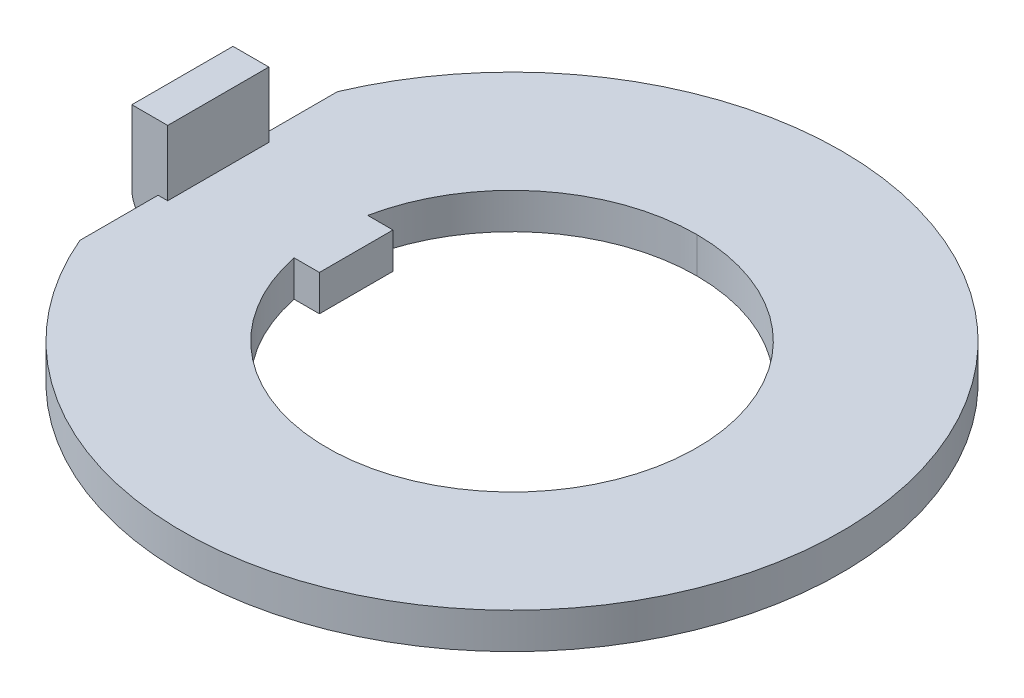
ISO-10303-21;
HEADER;
FILE_DESCRIPTION(('STEP AP214'),'2;1');
FILE_NAME('part.step','',(''),(''),'','','');
FILE_SCHEMA(('AUTOMOTIVE_DESIGN { 1 0 10303 214 1 1 1 1 }'));
ENDSEC;
DATA;
#1=APPLICATION_CONTEXT('core data for automotive mechanical design processes');
#2=APPLICATION_PROTOCOL_DEFINITION('international standard','automotive_design',2000,#1);
#3=PRODUCT_CONTEXT('',#1,'mechanical');
#4=PRODUCT('Part','Part','',(#3));
#5=PRODUCT_RELATED_PRODUCT_CATEGORY('part','',(#4));
#6=PRODUCT_DEFINITION_FORMATION('','',#4);
#7=PRODUCT_DEFINITION_CONTEXT('part definition',#1,'design');
#8=PRODUCT_DEFINITION('design','',#6,#7);
#9=PRODUCT_DEFINITION_SHAPE('','',#8);
#10=(LENGTH_UNIT() NAMED_UNIT(*) SI_UNIT(.MILLI.,.METRE.));
#11=(NAMED_UNIT(*) PLANE_ANGLE_UNIT() SI_UNIT($,.RADIAN.));
#12=(NAMED_UNIT(*) SI_UNIT($,.STERADIAN.) SOLID_ANGLE_UNIT());
#13=UNCERTAINTY_MEASURE_WITH_UNIT(LENGTH_MEASURE(1.E-05),#10,'distance_accuracy_value','');
#14=(GEOMETRIC_REPRESENTATION_CONTEXT(3) GLOBAL_UNCERTAINTY_ASSIGNED_CONTEXT((#13)) GLOBAL_UNIT_ASSIGNED_CONTEXT((#10,
#11,#12)) REPRESENTATION_CONTEXT('',''));
#15=CARTESIAN_POINT('',(0.,0.,0.));
#16=DIRECTION('',(0.,0.,1.));
#17=DIRECTION('',(1.,0.,0.));
#18=AXIS2_PLACEMENT_3D('',#15,#16,#17);
#19=CARTESIAN_POINT('',(-8.382,0.4953,-3.55801782036011));
#20=DIRECTION('',(1.,0.,0.));
#21=DIRECTION('',(0.,0.,-1.));
#22=AXIS2_PLACEMENT_3D('',#19,#20,#21);
#23=PLANE('',#22);
#24=DIRECTION('',(0.,0.,1.));
#25=VECTOR('',#24,1.);
#26=CARTESIAN_POINT('',(-8.382,0.4953,-3.55801782036011));
#27=LINE('',#26,#25);
#28=CARTESIAN_POINT('',(-8.382,0.4953,1.397));
#29=VERTEX_POINT('',#28);
#30=CARTESIAN_POINT('',(-8.382,0.4953,3.55801782036011));
#31=VERTEX_POINT('',#30);
#32=EDGE_CURVE('E11',#29,#31,#27,.T.);
#33=ORIENTED_EDGE('',*,*,#32,.F.);
#34=DIRECTION('',(0.,-1.,0.));
#35=VECTOR('',#34,1.);
#36=CARTESIAN_POINT('',(-8.382,0.4953,1.397));
#37=LINE('',#36,#35);
#38=CARTESIAN_POINT('',(-8.382,-0.49434690394219,1.397));
#39=VERTEX_POINT('',#38);
#40=EDGE_CURVE('E24',#29,#39,#37,.T.);
#41=ORIENTED_EDGE('',*,*,#40,.T.);
#42=DIRECTION('',(0.,0.,-1.));
#43=VECTOR('',#42,1.);
#44=CARTESIAN_POINT('',(-8.382,-0.49434690394219,1.397));
#45=LINE('',#44,#43);
#46=CARTESIAN_POINT('',(-8.382,-0.49434690394219,-1.397));
#47=VERTEX_POINT('',#46);
#48=EDGE_CURVE('E302',#39,#47,#45,.T.);
#49=ORIENTED_EDGE('',*,*,#48,.T.);
#50=DIRECTION('',(0.,-1.,0.));
#51=VECTOR('',#50,1.);
#52=CARTESIAN_POINT('',(-8.382,0.4953,-1.397));
#53=LINE('',#52,#51);
#54=CARTESIAN_POINT('',(-8.382,0.4953,-1.397));
#55=VERTEX_POINT('',#54);
#56=EDGE_CURVE('E298',#55,#47,#53,.T.);
#57=ORIENTED_EDGE('',*,*,#56,.F.);
#58=DIRECTION('',(0.,0.,1.));
#59=VECTOR('',#58,1.);
#60=CARTESIAN_POINT('',(-8.382,0.4953,-3.55801782036011));
#61=LINE('',#60,#59);
#62=CARTESIAN_POINT('',(-8.382,0.4953,-3.55801782036011));
#63=VERTEX_POINT('',#62);
#64=EDGE_CURVE('E293',#63,#55,#61,.T.);
#65=ORIENTED_EDGE('',*,*,#64,.F.);
#66=DIRECTION('',(0.,-1.,0.));
#67=VECTOR('',#66,1.);
#68=CARTESIAN_POINT('',(-8.382,0.4953,-3.55801782036011));
#69=LINE('',#68,#67);
#70=CARTESIAN_POINT('',(-8.382,-0.4953,-3.55801782036011));
#71=VERTEX_POINT('',#70);
#72=EDGE_CURVE('E289',#63,#71,#69,.T.);
#73=ORIENTED_EDGE('',*,*,#72,.T.);
#74=DIRECTION('',(0.,0.,1.));
#75=VECTOR('',#74,1.);
#76=CARTESIAN_POINT('',(-8.382,-0.4953,-3.55801782036011));
#77=LINE('',#76,#75);
#78=CARTESIAN_POINT('',(-8.382,-0.4953,3.55801782036011));
#79=VERTEX_POINT('',#78);
#80=EDGE_CURVE('E285',#71,#79,#77,.T.);
#81=ORIENTED_EDGE('',*,*,#80,.T.);
#82=DIRECTION('',(0.,-1.,0.));
#83=VECTOR('',#82,1.);
#84=CARTESIAN_POINT('',(-8.382,0.4953,3.55801782036011));
#85=LINE('',#84,#83);
#86=EDGE_CURVE('E280',#31,#79,#85,.T.);
#87=ORIENTED_EDGE('',*,*,#86,.F.);
#88=EDGE_LOOP('',(#33,#41,#49,#57,#65,#73,#81,#87));
#89=FACE_BOUND('',#88,.T.);
#90=ADVANCED_FACE('F16',(#89),#23,.F.);
#91=CARTESIAN_POINT('',(0.,0.4953,0.));
#92=DIRECTION('',(0.,1.,0.));
#93=DIRECTION('',(0.,0.,-1.));
#94=AXIS2_PLACEMENT_3D('',#91,#92,#93);
#95=CYLINDRICAL_SURFACE('',#94,9.1059);
#96=CARTESIAN_POINT('',(0.,-0.4953,0.));
#97=DIRECTION('',(0.,1.,0.));
#98=DIRECTION('',(1.,0.,0.));
#99=AXIS2_PLACEMENT_3D('',#96,#97,#98);
#100=CIRCLE('',#99,9.1059);
#101=CARTESIAN_POINT('',(0.,-0.4953,-9.1059));
#102=VERTEX_POINT('',#101);
#103=EDGE_CURVE('E276',#79,#102,#100,.T.);
#104=ORIENTED_EDGE('',*,*,#103,.T.);
#105=DIRECTION('',(0.,1.,0.));
#106=VECTOR('',#105,1.);
#107=CARTESIAN_POINT('',(0.,-0.4953,-9.1059));
#108=LINE('',#107,#106);
#109=CARTESIAN_POINT('',(0.,0.4953,-9.1059));
#110=VERTEX_POINT('',#109);
#111=EDGE_CURVE('E272',#102,#110,#108,.T.);
#112=ORIENTED_EDGE('',*,*,#111,.T.);
#113=CARTESIAN_POINT('',(0.,0.4953,0.));
#114=DIRECTION('',(0.,1.,0.));
#115=DIRECTION('',(1.,0.,0.));
#116=AXIS2_PLACEMENT_3D('',#113,#114,#115);
#117=CIRCLE('',#116,9.1059);
#118=EDGE_CURVE('E267',#31,#110,#117,.T.);
#119=ORIENTED_EDGE('',*,*,#118,.F.);
#120=ORIENTED_EDGE('',*,*,#86,.T.);
#121=EDGE_LOOP('',(#104,#112,#119,#120));
#122=FACE_BOUND('',#121,.T.);
#123=ADVANCED_FACE('F335',(#122),#95,.T.);
#124=CARTESIAN_POINT('',(0.,0.4953,0.));
#125=DIRECTION('',(0.,1.,0.));
#126=DIRECTION('',(0.,0.,1.));
#127=AXIS2_PLACEMENT_3D('',#124,#125,#126);
#128=PLANE('',#127);
#129=DIRECTION('',(1.,0.,0.));
#130=VECTOR('',#129,1.);
#131=CARTESIAN_POINT('',(0.,0.4953,1.397));
#132=LINE('',#131,#130);
#133=CARTESIAN_POINT('',(-8.1153,0.4953,1.397));
#134=VERTEX_POINT('',#133);
#135=EDGE_CURVE('E262',#29,#134,#132,.T.);
#136=ORIENTED_EDGE('',*,*,#135,.F.);
#137=ORIENTED_EDGE('',*,*,#32,.T.);
#138=ORIENTED_EDGE('',*,*,#118,.T.);
#139=CARTESIAN_POINT('',(0.,0.4953,0.));
#140=DIRECTION('',(0.,1.,0.));
#141=DIRECTION('',(1.,0.,0.));
#142=AXIS2_PLACEMENT_3D('',#139,#140,#141);
#143=CIRCLE('',#142,9.1059);
#144=EDGE_CURVE('E257',#110,#63,#143,.T.);
#145=ORIENTED_EDGE('',*,*,#144,.T.);
#146=ORIENTED_EDGE('',*,*,#64,.T.);
#147=DIRECTION('',(1.,0.,0.));
#148=VECTOR('',#147,1.);
#149=CARTESIAN_POINT('',(0.,0.4953,-1.397));
#150=LINE('',#149,#148);
#151=CARTESIAN_POINT('',(-8.1153,0.4953,-1.397));
#152=VERTEX_POINT('',#151);
#153=EDGE_CURVE('E253',#55,#152,#150,.T.);
#154=ORIENTED_EDGE('',*,*,#153,.T.);
#155=DIRECTION('',(0.,0.,1.));
#156=VECTOR('',#155,1.);
#157=CARTESIAN_POINT('',(-8.1153,0.4953,0.));
#158=LINE('',#157,#156);
#159=EDGE_CURVE('E249',#152,#134,#158,.T.);
#160=ORIENTED_EDGE('',*,*,#159,.T.);
#161=EDGE_LOOP('',(#136,#137,#138,#145,#146,#154,#160));
#162=FACE_BOUND('',#161,.T.);
#163=DIRECTION('',(-1.,0.,0.));
#164=VECTOR('',#163,1.);
#165=CARTESIAN_POINT('',(-4.3053,0.4953,1.016));
#166=LINE('',#165,#164);
#167=CARTESIAN_POINT('',(-4.3053,0.4953,1.016));
#168=VERTEX_POINT('',#167);
#169=CARTESIAN_POINT('',(-5.00328423737849,0.4953,1.01599999999999));
#170=VERTEX_POINT('',#169);
#171=EDGE_CURVE('E244',#168,#170,#166,.T.);
#172=ORIENTED_EDGE('',*,*,#171,.F.);
#173=DIRECTION('',(0.,0.,1.));
#174=VECTOR('',#173,1.);
#175=CARTESIAN_POINT('',(-4.3053,0.4953,-1.016));
#176=LINE('',#175,#174);
#177=CARTESIAN_POINT('',(-4.3053,0.4953,-1.016));
#178=VERTEX_POINT('',#177);
#179=EDGE_CURVE('E239',#178,#168,#176,.T.);
#180=ORIENTED_EDGE('',*,*,#179,.F.);
#181=DIRECTION('',(1.,0.,0.));
#182=VECTOR('',#181,1.);
#183=CARTESIAN_POINT('',(-5.00328423737849,0.4953,-1.016));
#184=LINE('',#183,#182);
#185=CARTESIAN_POINT('',(-5.00328423737849,0.4953,-1.016));
#186=VERTEX_POINT('',#185);
#187=EDGE_CURVE('E234',#186,#178,#184,.T.);
#188=ORIENTED_EDGE('',*,*,#187,.F.);
#189=CARTESIAN_POINT('',(0.,0.4953,0.));
#190=DIRECTION('',(0.,1.,0.));
#191=DIRECTION('',(1.,0.,0.));
#192=AXIS2_PLACEMENT_3D('',#189,#190,#191);
#193=CIRCLE('',#192,5.1054);
#194=CARTESIAN_POINT('',(0.,0.4953,-5.1054));
#195=VERTEX_POINT('',#194);
#196=EDGE_CURVE('E229',#195,#186,#193,.T.);
#197=ORIENTED_EDGE('',*,*,#196,.F.);
#198=CARTESIAN_POINT('',(0.,0.4953,0.));
#199=DIRECTION('',(0.,1.,0.));
#200=DIRECTION('',(1.,0.,0.));
#201=AXIS2_PLACEMENT_3D('',#198,#199,#200);
#202=CIRCLE('',#201,5.1054);
#203=EDGE_CURVE('E224',#170,#195,#202,.T.);
#204=ORIENTED_EDGE('',*,*,#203,.F.);
#205=EDGE_LOOP('',(#172,#180,#188,#197,#204));
#206=FACE_BOUND('',#205,.T.);
#207=ADVANCED_FACE('F316',(#162,#206),#128,.T.);
#208=CARTESIAN_POINT('',(0.,0.4953,0.));
#209=DIRECTION('',(0.,1.,0.));
#210=DIRECTION('',(0.,0.,-1.));
#211=AXIS2_PLACEMENT_3D('',#208,#209,#210);
#212=CYLINDRICAL_SURFACE('',#211,5.1054);
#213=CARTESIAN_POINT('',(0.,-0.4953,0.));
#214=DIRECTION('',(0.,1.,0.));
#215=DIRECTION('',(1.,0.,0.));
#216=AXIS2_PLACEMENT_3D('',#213,#214,#215);
#217=CIRCLE('',#216,5.1054);
#218=CARTESIAN_POINT('',(-5.00328423737849,-0.4953,1.01599999999999));
#219=VERTEX_POINT('',#218);
#220=CARTESIAN_POINT('',(0.,-0.4953,-5.1054));
#221=VERTEX_POINT('',#220);
#222=EDGE_CURVE('E219',#219,#221,#217,.T.);
#223=ORIENTED_EDGE('',*,*,#222,.F.);
#224=DIRECTION('',(0.,-1.,0.));
#225=VECTOR('',#224,1.);
#226=CARTESIAN_POINT('',(-5.00328423737849,0.4953,1.01599999999999));
#227=LINE('',#226,#225);
#228=EDGE_CURVE('E214',#170,#219,#227,.T.);
#229=ORIENTED_EDGE('',*,*,#228,.F.);
#230=ORIENTED_EDGE('',*,*,#203,.T.);
#231=DIRECTION('',(0.,1.,0.));
#232=VECTOR('',#231,1.);
#233=CARTESIAN_POINT('',(0.,-0.4953,-5.1054));
#234=LINE('',#233,#232);
#235=EDGE_CURVE('E209',#221,#195,#234,.T.);
#236=ORIENTED_EDGE('',*,*,#235,.F.);
#237=EDGE_LOOP('',(#223,#229,#230,#236));
#238=FACE_BOUND('',#237,.T.);
#239=ADVANCED_FACE('F342',(#238),#212,.F.);
#240=CARTESIAN_POINT('',(0.,0.4953,0.));
#241=DIRECTION('',(0.,1.,0.));
#242=DIRECTION('',(0.,0.,-1.));
#243=AXIS2_PLACEMENT_3D('',#240,#241,#242);
#244=CYLINDRICAL_SURFACE('',#243,5.1054);
#245=DIRECTION('',(0.,-1.,0.));
#246=VECTOR('',#245,1.);
#247=CARTESIAN_POINT('',(-5.00328423737849,0.4953,-1.016));
#248=LINE('',#247,#246);
#249=CARTESIAN_POINT('',(-5.00328423737849,-0.4953,-1.016));
#250=VERTEX_POINT('',#249);
#251=EDGE_CURVE('E205',#186,#250,#248,.T.);
#252=ORIENTED_EDGE('',*,*,#251,.T.);
#253=CARTESIAN_POINT('',(0.,-0.4953,0.));
#254=DIRECTION('',(0.,1.,0.));
#255=DIRECTION('',(1.,0.,0.));
#256=AXIS2_PLACEMENT_3D('',#253,#254,#255);
#257=CIRCLE('',#256,5.1054);
#258=EDGE_CURVE('E200',#221,#250,#257,.T.);
#259=ORIENTED_EDGE('',*,*,#258,.F.);
#260=ORIENTED_EDGE('',*,*,#235,.T.);
#261=ORIENTED_EDGE('',*,*,#196,.T.);
#262=EDGE_LOOP('',(#252,#259,#260,#261));
#263=FACE_BOUND('',#262,.T.);
#264=ADVANCED_FACE('F347',(#263),#244,.F.);
#265=CARTESIAN_POINT('',(0.,-0.4953,0.));
#266=DIRECTION('',(0.,1.,0.));
#267=DIRECTION('',(0.,0.,1.));
#268=AXIS2_PLACEMENT_3D('',#265,#266,#267);
#269=PLANE('',#268);
#270=DIRECTION('',(-1.,0.,0.));
#271=VECTOR('',#270,1.);
#272=CARTESIAN_POINT('',(-4.3053,-0.4953,1.016));
#273=LINE('',#272,#271);
#274=CARTESIAN_POINT('',(-4.3053,-0.4953,1.016));
#275=VERTEX_POINT('',#274);
#276=EDGE_CURVE('E195',#275,#219,#273,.T.);
#277=ORIENTED_EDGE('',*,*,#276,.T.);
#278=ORIENTED_EDGE('',*,*,#222,.T.);
#279=ORIENTED_EDGE('',*,*,#258,.T.);
#280=DIRECTION('',(1.,0.,0.));
#281=VECTOR('',#280,1.);
#282=CARTESIAN_POINT('',(-5.00328423737849,-0.4953,-1.016));
#283=LINE('',#282,#281);
#284=CARTESIAN_POINT('',(-4.3053,-0.4953,-1.016));
#285=VERTEX_POINT('',#284);
#286=EDGE_CURVE('E191',#250,#285,#283,.T.);
#287=ORIENTED_EDGE('',*,*,#286,.T.);
#288=DIRECTION('',(0.,0.,1.));
#289=VECTOR('',#288,1.);
#290=CARTESIAN_POINT('',(-4.3053,-0.4953,-1.016));
#291=LINE('',#290,#289);
#292=EDGE_CURVE('E187',#285,#275,#291,.T.);
#293=ORIENTED_EDGE('',*,*,#292,.T.);
#294=EDGE_LOOP('',(#277,#278,#279,#287,#293));
#295=FACE_BOUND('',#294,.T.);
#296=CARTESIAN_POINT('',(0.,-0.4953,0.));
#297=DIRECTION('',(0.,1.,0.));
#298=DIRECTION('',(1.,0.,0.));
#299=AXIS2_PLACEMENT_3D('',#296,#297,#298);
#300=CIRCLE('',#299,9.1059);
#301=EDGE_CURVE('E182',#102,#71,#300,.T.);
#302=ORIENTED_EDGE('',*,*,#301,.F.);
#303=ORIENTED_EDGE('',*,*,#103,.F.);
#304=ORIENTED_EDGE('',*,*,#80,.F.);
#305=EDGE_LOOP('',(#302,#303,#304));
#306=FACE_BOUND('',#305,.T.);
#307=ADVANCED_FACE('F334',(#295,#306),#269,.F.);
#308=CARTESIAN_POINT('',(0.,0.4953,0.));
#309=DIRECTION('',(0.,1.,0.));
#310=DIRECTION('',(0.,0.,-1.));
#311=AXIS2_PLACEMENT_3D('',#308,#309,#310);
#312=CYLINDRICAL_SURFACE('',#311,9.1059);
#313=ORIENTED_EDGE('',*,*,#301,.T.);
#314=ORIENTED_EDGE('',*,*,#72,.F.);
#315=ORIENTED_EDGE('',*,*,#144,.F.);
#316=ORIENTED_EDGE('',*,*,#111,.F.);
#317=EDGE_LOOP('',(#313,#314,#315,#316));
#318=FACE_BOUND('',#317,.T.);
#319=ADVANCED_FACE('F329',(#318),#312,.T.);
#320=CARTESIAN_POINT('',(-4.3053,0.4953,-1.016));
#321=DIRECTION('',(1.,0.,0.));
#322=DIRECTION('',(0.,0.,-1.));
#323=AXIS2_PLACEMENT_3D('',#320,#321,#322);
#324=PLANE('',#323);
#325=ORIENTED_EDGE('',*,*,#292,.F.);
#326=DIRECTION('',(0.,-1.,0.));
#327=VECTOR('',#326,1.);
#328=CARTESIAN_POINT('',(-4.3053,0.4953,-1.016));
#329=LINE('',#328,#327);
#330=EDGE_CURVE('E177',#178,#285,#329,.T.);
#331=ORIENTED_EDGE('',*,*,#330,.F.);
#332=ORIENTED_EDGE('',*,*,#179,.T.);
#333=DIRECTION('',(0.,-1.,0.));
#334=VECTOR('',#333,1.);
#335=CARTESIAN_POINT('',(-4.3053,0.4953,1.016));
#336=LINE('',#335,#334);
#337=EDGE_CURVE('E172',#168,#275,#336,.T.);
#338=ORIENTED_EDGE('',*,*,#337,.T.);
#339=EDGE_LOOP('',(#325,#331,#332,#338));
#340=FACE_BOUND('',#339,.T.);
#341=ADVANCED_FACE('F357',(#340),#324,.T.);
#342=CARTESIAN_POINT('',(-4.3053,0.4953,1.016));
#343=DIRECTION('',(0.,0.,1.));
#344=DIRECTION('',(1.,0.,0.));
#345=AXIS2_PLACEMENT_3D('',#342,#343,#344);
#346=PLANE('',#345);
#347=ORIENTED_EDGE('',*,*,#276,.F.);
#348=ORIENTED_EDGE('',*,*,#337,.F.);
#349=ORIENTED_EDGE('',*,*,#171,.T.);
#350=ORIENTED_EDGE('',*,*,#228,.T.);
#351=EDGE_LOOP('',(#347,#348,#349,#350));
#352=FACE_BOUND('',#351,.T.);
#353=ADVANCED_FACE('F360',(#352),#346,.T.);
#354=CARTESIAN_POINT('',(-5.00328423737849,0.4953,-1.016));
#355=DIRECTION('',(0.,0.,-1.));
#356=DIRECTION('',(-1.,0.,0.));
#357=AXIS2_PLACEMENT_3D('',#354,#355,#356);
#358=PLANE('',#357);
#359=ORIENTED_EDGE('',*,*,#286,.F.);
#360=ORIENTED_EDGE('',*,*,#251,.F.);
#361=ORIENTED_EDGE('',*,*,#187,.T.);
#362=ORIENTED_EDGE('',*,*,#330,.T.);
#363=EDGE_LOOP('',(#359,#360,#361,#362));
#364=FACE_BOUND('',#363,.T.);
#365=ADVANCED_FACE('F364',(#364),#358,.T.);
#366=CARTESIAN_POINT('',(-8.1153,-0.4953,1.397));
#367=DIRECTION('',(-1.,0.,0.));
#368=DIRECTION('',(0.,0.,1.));
#369=AXIS2_PLACEMENT_3D('',#366,#367,#368);
#370=PLANE('',#369);
#371=ORIENTED_EDGE('',*,*,#159,.F.);
#372=DIRECTION('',(0.,1.,0.));
#373=VECTOR('',#372,1.);
#374=CARTESIAN_POINT('',(-8.1153,-0.4953,-1.397));
#375=LINE('',#374,#373);
#376=CARTESIAN_POINT('',(-8.1153,2.2987,-1.397));
#377=VERTEX_POINT('',#376);
#378=EDGE_CURVE('E168',#152,#377,#375,.T.);
#379=ORIENTED_EDGE('',*,*,#378,.T.);
#380=DIRECTION('',(0.,0.,-1.));
#381=VECTOR('',#380,1.);
#382=CARTESIAN_POINT('',(-8.1153,2.2987,1.397));
#383=LINE('',#382,#381);
#384=CARTESIAN_POINT('',(-8.1153,2.2987,1.397));
#385=VERTEX_POINT('',#384);
#386=EDGE_CURVE('E129',#385,#377,#383,.T.);
#387=ORIENTED_EDGE('',*,*,#386,.F.);
#388=DIRECTION('',(0.,1.,0.));
#389=VECTOR('',#388,1.);
#390=CARTESIAN_POINT('',(-8.1153,-0.4953,1.397));
#391=LINE('',#390,#389);
#392=EDGE_CURVE('E160',#134,#385,#391,.T.);
#393=ORIENTED_EDGE('',*,*,#392,.F.);
#394=EDGE_LOOP('',(#371,#379,#387,#393));
#395=FACE_BOUND('',#394,.T.);
#396=ADVANCED_FACE('F320',(#395),#370,.F.);
#397=CARTESIAN_POINT('',(-8.34389999999992,0.266700000000086,1.397));
#398=DIRECTION('',(0.,0.,1.));
#399=DIRECTION('',(1.,0.,0.));
#400=AXIS2_PLACEMENT_3D('',#397,#398,#399);
#401=PLANE('',#400);
#402=ORIENTED_EDGE('',*,*,#40,.F.);
#403=ORIENTED_EDGE('',*,*,#135,.T.);
#404=ORIENTED_EDGE('',*,*,#392,.T.);
#405=DIRECTION('',(-1.,0.,0.));
#406=VECTOR('',#405,1.);
#407=CARTESIAN_POINT('',(-8.1153,2.2987,1.397));
#408=LINE('',#407,#406);
#409=CARTESIAN_POINT('',(-9.1059,2.2987,1.397));
#410=VERTEX_POINT('',#409);
#411=EDGE_CURVE('E156',#385,#410,#408,.T.);
#412=ORIENTED_EDGE('',*,*,#411,.T.);
#413=DIRECTION('',(0.,-1.,0.));
#414=VECTOR('',#413,1.);
#415=CARTESIAN_POINT('',(-9.1059,2.2987,1.397));
#416=LINE('',#415,#414);
#417=CARTESIAN_POINT('',(-9.1059,0.266700000000086,1.397));
#418=VERTEX_POINT('',#417);
#419=EDGE_CURVE('E121',#410,#418,#416,.T.);
#420=ORIENTED_EDGE('',*,*,#419,.T.);
#421=CARTESIAN_POINT('',(-8.34389999999992,0.266700000000086,1.397));
#422=DIRECTION('',(0.,0.,1.));
#423=DIRECTION('',(1.,0.,0.));
#424=AXIS2_PLACEMENT_3D('',#421,#422,#423);
#425=CIRCLE('',#424,0.762000000000086);
#426=EDGE_CURVE('E149',#418,#39,#425,.T.);
#427=ORIENTED_EDGE('',*,*,#426,.T.);
#428=EDGE_LOOP('',(#402,#403,#404,#412,#420,#427));
#429=FACE_BOUND('',#428,.T.);
#430=ADVANCED_FACE('F322',(#429),#401,.T.);
#431=CARTESIAN_POINT('',(-8.34389999999992,0.266700000000086,1.397));
#432=DIRECTION('',(0.,0.,1.));
#433=DIRECTION('',(0.724568837309504,0.689202437604477,0.));
#434=AXIS2_PLACEMENT_3D('',#431,#432,#433);
#435=CYLINDRICAL_SURFACE('',#434,0.762000000000086);
#436=CARTESIAN_POINT('',(-8.34389999999992,0.266700000000086,-1.397));
#437=DIRECTION('',(0.,0.,1.));
#438=DIRECTION('',(1.,0.,0.));
#439=AXIS2_PLACEMENT_3D('',#436,#437,#438);
#440=CIRCLE('',#439,0.762000000000086);
#441=CARTESIAN_POINT('',(-9.1059,0.266700000000086,-1.397));
#442=VERTEX_POINT('',#441);
#443=EDGE_CURVE('E137',#442,#47,#440,.T.);
#444=ORIENTED_EDGE('',*,*,#443,.T.);
#445=ORIENTED_EDGE('',*,*,#48,.F.);
#446=ORIENTED_EDGE('',*,*,#426,.F.);
#447=DIRECTION('',(0.,0.,-1.));
#448=VECTOR('',#447,1.);
#449=CARTESIAN_POINT('',(-9.1059,0.266700000000086,1.397));
#450=LINE('',#449,#448);
#451=EDGE_CURVE('E138',#418,#442,#450,.T.);
#452=ORIENTED_EDGE('',*,*,#451,.T.);
#453=EDGE_LOOP('',(#444,#445,#446,#452));
#454=FACE_BOUND('',#453,.T.);
#455=ADVANCED_FACE('F313',(#454),#435,.T.);
#456=CARTESIAN_POINT('',(-9.1059,2.2987,1.397));
#457=DIRECTION('',(1.,0.,0.));
#458=DIRECTION('',(0.,0.,-1.));
#459=AXIS2_PLACEMENT_3D('',#456,#457,#458);
#460=PLANE('',#459);
#461=DIRECTION('',(0.,-1.,0.));
#462=VECTOR('',#461,1.);
#463=CARTESIAN_POINT('',(-9.1059,2.2987,-1.397));
#464=LINE('',#463,#462);
#465=CARTESIAN_POINT('',(-9.1059,2.2987,-1.397));
#466=VERTEX_POINT('',#465);
#467=EDGE_CURVE('E119',#466,#442,#464,.T.);
#468=ORIENTED_EDGE('',*,*,#467,.T.);
#469=ORIENTED_EDGE('',*,*,#451,.F.);
#470=ORIENTED_EDGE('',*,*,#419,.F.);
#471=DIRECTION('',(0.,0.,-1.));
#472=VECTOR('',#471,1.);
#473=CARTESIAN_POINT('',(-9.1059,2.2987,1.397));
#474=LINE('',#473,#472);
#475=EDGE_CURVE('E114',#410,#466,#474,.T.);
#476=ORIENTED_EDGE('',*,*,#475,.T.);
#477=EDGE_LOOP('',(#468,#469,#470,#476));
#478=FACE_BOUND('',#477,.T.);
#479=ADVANCED_FACE('F116',(#478),#460,.F.);
#480=CARTESIAN_POINT('',(-8.1153,2.2987,1.397));
#481=DIRECTION('',(0.,-1.,0.));
#482=DIRECTION('',(0.,0.,-1.));
#483=AXIS2_PLACEMENT_3D('',#480,#481,#482);
#484=PLANE('',#483);
#485=DIRECTION('',(-1.,0.,0.));
#486=VECTOR('',#485,1.);
#487=CARTESIAN_POINT('',(-8.1153,2.2987,-1.397));
#488=LINE('',#487,#486);
#489=EDGE_CURVE('E124',#377,#466,#488,.T.);
#490=ORIENTED_EDGE('',*,*,#489,.T.);
#491=ORIENTED_EDGE('',*,*,#475,.F.);
#492=ORIENTED_EDGE('',*,*,#411,.F.);
#493=ORIENTED_EDGE('',*,*,#386,.T.);
#494=EDGE_LOOP('',(#490,#491,#492,#493));
#495=FACE_BOUND('',#494,.T.);
#496=ADVANCED_FACE('F128',(#495),#484,.F.);
#497=CARTESIAN_POINT('',(-8.34389999999992,0.266700000000086,-1.397));
#498=DIRECTION('',(0.,0.,1.));
#499=DIRECTION('',(1.,0.,0.));
#500=AXIS2_PLACEMENT_3D('',#497,#498,#499);
#501=PLANE('',#500);
#502=ORIENTED_EDGE('',*,*,#153,.F.);
#503=ORIENTED_EDGE('',*,*,#56,.T.);
#504=ORIENTED_EDGE('',*,*,#443,.F.);
#505=ORIENTED_EDGE('',*,*,#467,.F.);
#506=ORIENTED_EDGE('',*,*,#489,.F.);
#507=ORIENTED_EDGE('',*,*,#378,.F.);
#508=EDGE_LOOP('',(#502,#503,#504,#505,#506,#507));
#509=FACE_BOUND('',#508,.T.);
#510=ADVANCED_FACE('F134',(#509),#501,.F.);
#511=CLOSED_SHELL('',(#90,#123,#207,#239,#264,#307,#319,#341,#353,#365,#396,#430,#455,#479,#496,#510));
#512=MANIFOLD_SOLID_BREP('B1',#511);
#513=ADVANCED_BREP_SHAPE_REPRESENTATION('',(#18,#512),#14);
#514=SHAPE_DEFINITION_REPRESENTATION(#9,#513);
ENDSEC;
END-ISO-10303-21;
